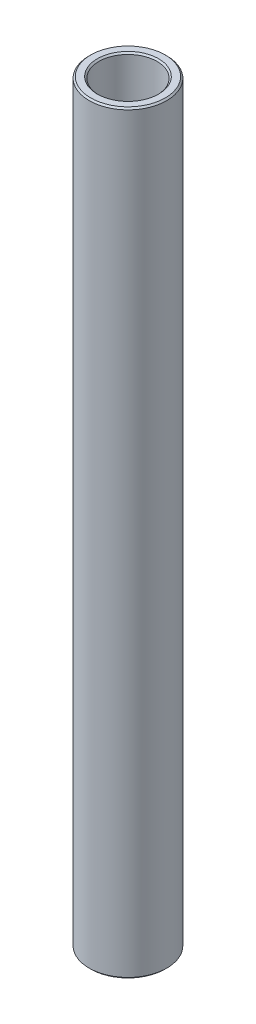
ISO-10303-21;
HEADER;
FILE_DESCRIPTION(('STEP AP214'),'2;1');
FILE_NAME('part.step','',(''),(''),'','','');
FILE_SCHEMA(('AUTOMOTIVE_DESIGN { 1 0 10303 214 1 1 1 1 }'));
ENDSEC;
DATA;
#1=APPLICATION_CONTEXT('core data for automotive mechanical design processes');
#2=APPLICATION_PROTOCOL_DEFINITION('international standard','automotive_design',2000,#1);
#3=PRODUCT_CONTEXT('',#1,'mechanical');
#4=PRODUCT('Part','Part','',(#3));
#5=PRODUCT_RELATED_PRODUCT_CATEGORY('part','',(#4));
#6=PRODUCT_DEFINITION_FORMATION('','',#4);
#7=PRODUCT_DEFINITION_CONTEXT('part definition',#1,'design');
#8=PRODUCT_DEFINITION('design','',#6,#7);
#9=PRODUCT_DEFINITION_SHAPE('','',#8);
#10=(LENGTH_UNIT() NAMED_UNIT(*) SI_UNIT(.MILLI.,.METRE.));
#11=(NAMED_UNIT(*) PLANE_ANGLE_UNIT() SI_UNIT($,.RADIAN.));
#12=(NAMED_UNIT(*) SI_UNIT($,.STERADIAN.) SOLID_ANGLE_UNIT());
#13=UNCERTAINTY_MEASURE_WITH_UNIT(LENGTH_MEASURE(1.E-05),#10,'distance_accuracy_value','');
#14=(GEOMETRIC_REPRESENTATION_CONTEXT(3) GLOBAL_UNCERTAINTY_ASSIGNED_CONTEXT((#13)) GLOBAL_UNIT_ASSIGNED_CONTEXT((#10,
#11,#12)) REPRESENTATION_CONTEXT('',''));
#15=CARTESIAN_POINT('',(0.,0.,0.));
#16=DIRECTION('',(0.,0.,1.));
#17=DIRECTION('',(1.,0.,0.));
#18=AXIS2_PLACEMENT_3D('',#15,#16,#17);
#19=CARTESIAN_POINT('',(0.,11.60859375,0.));
#20=DIRECTION('',(0.,1.,0.));
#21=DIRECTION('',(-1.,0.,0.));
#22=AXIS2_PLACEMENT_3D('',#19,#20,#21);
#23=CYLINDRICAL_SURFACE('',#22,4.7625);
#24=CARTESIAN_POINT('',(0.,-61.462285,0.));
#25=DIRECTION('',(0.,1.,0.));
#26=DIRECTION('',(-1.,0.,0.));
#27=AXIS2_PLACEMENT_3D('',#24,#25,#26);
#28=CIRCLE('',#27,4.7625);
#29=CARTESIAN_POINT('',(-4.76250000000001,-61.462285,0.));
#30=VERTEX_POINT('',#29);
#31=EDGE_CURVE('E50',#30,#30,#28,.F.);
#32=ORIENTED_EDGE('',*,*,#31,.T.);
#33=EDGE_LOOP('',(#32));
#34=FACE_BOUND('',#33,.T.);
#35=CARTESIAN_POINT('',(0.,61.462285,0.));
#36=DIRECTION('',(0.,-1.,0.));
#37=DIRECTION('',(1.,0.,0.));
#38=AXIS2_PLACEMENT_3D('',#35,#36,#37);
#39=CIRCLE('',#38,4.7625);
#40=CARTESIAN_POINT('',(4.76250000000001,61.462285,0.));
#41=VERTEX_POINT('',#40);
#42=EDGE_CURVE('E53',#41,#41,#39,.F.);
#43=ORIENTED_EDGE('',*,*,#42,.T.);
#44=EDGE_LOOP('',(#43));
#45=FACE_BOUND('',#44,.T.);
#46=ADVANCED_FACE('F30',(#34,#45),#23,.F.);
#47=CARTESIAN_POINT('',(4.76249999999999,61.716285,0.));
#48=DIRECTION('',(0.,-1.,0.));
#49=DIRECTION('',(1.,0.,0.));
#50=AXIS2_PLACEMENT_3D('',#47,#48,#49);
#51=PLANE('',#50);
#52=CARTESIAN_POINT('',(0.,61.716285,0.));
#53=DIRECTION('',(0.,-1.,0.));
#54=DIRECTION('',(1.,0.,0.));
#55=AXIS2_PLACEMENT_3D('',#52,#53,#54);
#56=CIRCLE('',#55,6.096);
#57=CARTESIAN_POINT('',(6.09600000000001,61.716285,0.));
#58=VERTEX_POINT('',#57);
#59=EDGE_CURVE('E10',#58,#58,#56,.F.);
#60=ORIENTED_EDGE('',*,*,#59,.T.);
#61=EDGE_LOOP('',(#60));
#62=FACE_BOUND('',#61,.T.);
#63=CARTESIAN_POINT('',(0.,61.716285,0.));
#64=DIRECTION('',(0.,-1.,0.));
#65=DIRECTION('',(1.,0.,0.));
#66=AXIS2_PLACEMENT_3D('',#63,#64,#65);
#67=CIRCLE('',#66,5.01650000000002);
#68=CARTESIAN_POINT('',(5.01650000000003,61.716285,0.));
#69=VERTEX_POINT('',#68);
#70=EDGE_CURVE('E37',#69,#69,#67,.T.);
#71=ORIENTED_EDGE('',*,*,#70,.T.);
#72=EDGE_LOOP('',(#71));
#73=FACE_BOUND('',#72,.T.);
#74=ADVANCED_FACE('F76',(#62,#73),#51,.F.);
#75=CARTESIAN_POINT('',(0.,11.60859375,0.));
#76=DIRECTION('',(0.,1.,0.));
#77=DIRECTION('',(-1.,0.,0.));
#78=AXIS2_PLACEMENT_3D('',#75,#76,#77);
#79=CYLINDRICAL_SURFACE('',#78,6.35);
#80=CARTESIAN_POINT('',(0.,-61.462285,0.));
#81=DIRECTION('',(0.,1.,0.));
#82=DIRECTION('',(-1.,0.,0.));
#83=AXIS2_PLACEMENT_3D('',#80,#81,#82);
#84=CIRCLE('',#83,6.35);
#85=CARTESIAN_POINT('',(-6.35000000000001,-61.462285,0.));
#86=VERTEX_POINT('',#85);
#87=EDGE_CURVE('E41',#86,#86,#84,.T.);
#88=ORIENTED_EDGE('',*,*,#87,.T.);
#89=EDGE_LOOP('',(#88));
#90=FACE_BOUND('',#89,.T.);
#91=CARTESIAN_POINT('',(0.,61.462285,0.));
#92=DIRECTION('',(0.,-1.,0.));
#93=DIRECTION('',(1.,0.,0.));
#94=AXIS2_PLACEMENT_3D('',#91,#92,#93);
#95=CIRCLE('',#94,6.35);
#96=CARTESIAN_POINT('',(6.35000000000001,61.462285,0.));
#97=VERTEX_POINT('',#96);
#98=EDGE_CURVE('E45',#97,#97,#95,.T.);
#99=ORIENTED_EDGE('',*,*,#98,.T.);
#100=EDGE_LOOP('',(#99));
#101=FACE_BOUND('',#100,.T.);
#102=ADVANCED_FACE('F73',(#90,#101),#79,.T.);
#103=CARTESIAN_POINT('',(6.35000000000001,-61.716285,0.));
#104=DIRECTION('',(0.,1.,0.));
#105=DIRECTION('',(-1.,0.,0.));
#106=AXIS2_PLACEMENT_3D('',#103,#104,#105);
#107=PLANE('',#106);
#108=CARTESIAN_POINT('',(0.,-61.716285,0.));
#109=DIRECTION('',(0.,1.,0.));
#110=DIRECTION('',(-1.,0.,0.));
#111=AXIS2_PLACEMENT_3D('',#108,#109,#110);
#112=CIRCLE('',#111,5.01649999999999);
#113=CARTESIAN_POINT('',(-5.0165,-61.716285,0.));
#114=VERTEX_POINT('',#113);
#115=EDGE_CURVE('E56',#114,#114,#112,.T.);
#116=ORIENTED_EDGE('',*,*,#115,.T.);
#117=EDGE_LOOP('',(#116));
#118=FACE_BOUND('',#117,.T.);
#119=CARTESIAN_POINT('',(0.,-61.716285,0.));
#120=DIRECTION('',(0.,1.,0.));
#121=DIRECTION('',(-1.,0.,0.));
#122=AXIS2_PLACEMENT_3D('',#119,#120,#121);
#123=CIRCLE('',#122,6.09599999999998);
#124=CARTESIAN_POINT('',(-6.09599999999998,-61.716285,0.));
#125=VERTEX_POINT('',#124);
#126=EDGE_CURVE('E59',#125,#125,#123,.F.);
#127=ORIENTED_EDGE('',*,*,#126,.T.);
#128=EDGE_LOOP('',(#127));
#129=FACE_BOUND('',#128,.T.);
#130=ADVANCED_FACE('F63',(#118,#129),#107,.F.);
#131=CARTESIAN_POINT('',(0.,-61.716285,0.));
#132=DIRECTION('',(0.,-1.,0.));
#133=DIRECTION('',(1.,0.,0.));
#134=AXIS2_PLACEMENT_3D('',#131,#132,#133);
#135=CONICAL_SURFACE('',#134,5.01649999999999,0.785398163397453);
#136=ORIENTED_EDGE('',*,*,#31,.F.);
#137=EDGE_LOOP('',(#136));
#138=FACE_BOUND('',#137,.T.);
#139=ORIENTED_EDGE('',*,*,#115,.F.);
#140=EDGE_LOOP('',(#139));
#141=FACE_BOUND('',#140,.T.);
#142=ADVANCED_FACE('F69',(#138,#141),#135,.F.);
#143=CARTESIAN_POINT('',(0.,-61.462285,0.));
#144=DIRECTION('',(0.,1.,0.));
#145=DIRECTION('',(-1.,0.,0.));
#146=AXIS2_PLACEMENT_3D('',#143,#144,#145);
#147=CONICAL_SURFACE('',#146,6.35,0.785398163397433);
#148=ORIENTED_EDGE('',*,*,#126,.F.);
#149=EDGE_LOOP('',(#148));
#150=FACE_BOUND('',#149,.T.);
#151=ORIENTED_EDGE('',*,*,#87,.F.);
#152=EDGE_LOOP('',(#151));
#153=FACE_BOUND('',#152,.T.);
#154=ADVANCED_FACE('F65',(#150,#153),#147,.T.);
#155=CARTESIAN_POINT('',(0.,61.716285,0.));
#156=DIRECTION('',(0.,-1.,0.));
#157=DIRECTION('',(1.,0.,0.));
#158=AXIS2_PLACEMENT_3D('',#155,#156,#157);
#159=CONICAL_SURFACE('',#158,6.096,0.785398163397474);
#160=ORIENTED_EDGE('',*,*,#98,.F.);
#161=EDGE_LOOP('',(#160));
#162=FACE_BOUND('',#161,.T.);
#163=ORIENTED_EDGE('',*,*,#59,.F.);
#164=EDGE_LOOP('',(#163));
#165=FACE_BOUND('',#164,.T.);
#166=ADVANCED_FACE('F68',(#162,#165),#159,.T.);
#167=CARTESIAN_POINT('',(0.,61.462285,0.));
#168=DIRECTION('',(0.,1.,0.));
#169=DIRECTION('',(-1.,0.,0.));
#170=AXIS2_PLACEMENT_3D('',#167,#168,#169);
#171=CONICAL_SURFACE('',#170,4.7625,0.785398163397453);
#172=ORIENTED_EDGE('',*,*,#70,.F.);
#173=EDGE_LOOP('',(#172));
#174=FACE_BOUND('',#173,.T.);
#175=ORIENTED_EDGE('',*,*,#42,.F.);
#176=EDGE_LOOP('',(#175));
#177=FACE_BOUND('',#176,.T.);
#178=ADVANCED_FACE('F32',(#174,#177),#171,.F.);
#179=CLOSED_SHELL('',(#46,#74,#102,#130,#142,#154,#166,#178));
#180=MANIFOLD_SOLID_BREP('B2',#179);
#181=ADVANCED_BREP_SHAPE_REPRESENTATION('',(#18,#180),#14);
#182=SHAPE_DEFINITION_REPRESENTATION(#9,#181);
ENDSEC;
END-ISO-10303-21;
